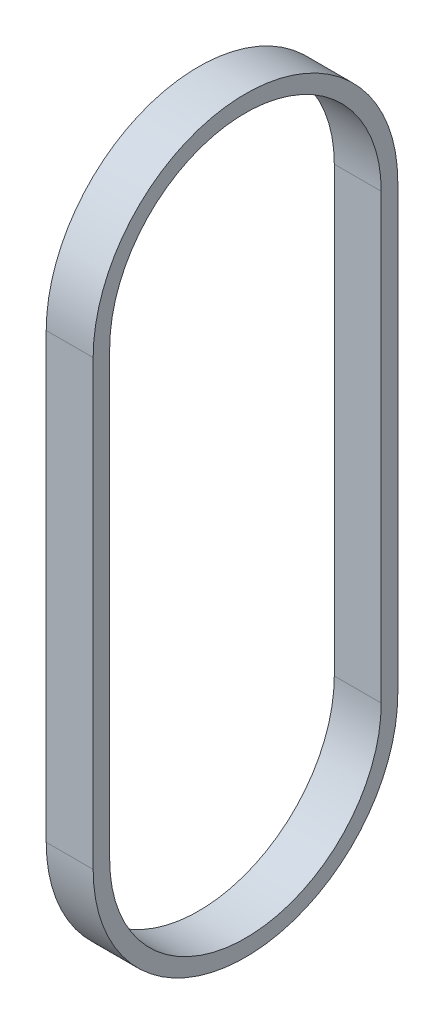
ISO-10303-21;
HEADER;
FILE_DESCRIPTION(('STEP AP214'),'2;1');
FILE_NAME('part.step','',(''),(''),'','','');
FILE_SCHEMA(('AUTOMOTIVE_DESIGN { 1 0 10303 214 1 1 1 1 }'));
ENDSEC;
DATA;
#1=APPLICATION_CONTEXT('core data for automotive mechanical design processes');
#2=APPLICATION_PROTOCOL_DEFINITION('international standard','automotive_design',2000,#1);
#3=PRODUCT_CONTEXT('',#1,'mechanical');
#4=PRODUCT('Part','Part','',(#3));
#5=PRODUCT_RELATED_PRODUCT_CATEGORY('part','',(#4));
#6=PRODUCT_DEFINITION_FORMATION('','',#4);
#7=PRODUCT_DEFINITION_CONTEXT('part definition',#1,'design');
#8=PRODUCT_DEFINITION('design','',#6,#7);
#9=PRODUCT_DEFINITION_SHAPE('','',#8);
#10=(LENGTH_UNIT() NAMED_UNIT(*) SI_UNIT(.MILLI.,.METRE.));
#11=(NAMED_UNIT(*) PLANE_ANGLE_UNIT() SI_UNIT($,.RADIAN.));
#12=(NAMED_UNIT(*) SI_UNIT($,.STERADIAN.) SOLID_ANGLE_UNIT());
#13=UNCERTAINTY_MEASURE_WITH_UNIT(LENGTH_MEASURE(1.E-05),#10,'distance_accuracy_value','');
#14=(GEOMETRIC_REPRESENTATION_CONTEXT(3) GLOBAL_UNCERTAINTY_ASSIGNED_CONTEXT((#13)) GLOBAL_UNIT_ASSIGNED_CONTEXT((#10,
#11,#12)) REPRESENTATION_CONTEXT('',''));
#15=CARTESIAN_POINT('',(0.,0.,0.));
#16=DIRECTION('',(0.,0.,1.));
#17=DIRECTION('',(1.,0.,0.));
#18=AXIS2_PLACEMENT_3D('',#15,#16,#17);
#19=CARTESIAN_POINT('',(9.,0.,0.));
#20=DIRECTION('',(1.,0.,0.));
#21=DIRECTION('',(0.,0.,-1.));
#22=AXIS2_PLACEMENT_3D('',#19,#20,#21);
#23=PLANE('',#22);
#24=CARTESIAN_POINT('',(9.,0.,0.));
#25=DIRECTION('',(1.,0.,0.));
#26=DIRECTION('',(0.,0.,-1.));
#27=AXIS2_PLACEMENT_3D('',#24,#25,#26);
#28=CIRCLE('',#27,29.21);
#29=CARTESIAN_POINT('',(9.,0.,29.21));
#30=VERTEX_POINT('',#29);
#31=CARTESIAN_POINT('',(9.,0.,-29.21));
#32=VERTEX_POINT('',#31);
#33=EDGE_CURVE('E136',#30,#32,#28,.T.);
#34=ORIENTED_EDGE('',*,*,#33,.T.);
#35=DIRECTION('',(0.,1.,0.));
#36=VECTOR('',#35,1.);
#37=CARTESIAN_POINT('',(9.,85.0011,-29.21));
#38=LINE('',#37,#36);
#39=CARTESIAN_POINT('',(9.,85.0011,-29.21));
#40=VERTEX_POINT('',#39);
#41=EDGE_CURVE('E139',#32,#40,#38,.T.);
#42=ORIENTED_EDGE('',*,*,#41,.T.);
#43=CARTESIAN_POINT('',(9.,85.0011,0.));
#44=DIRECTION('',(1.,0.,0.));
#45=DIRECTION('',(0.,0.,1.));
#46=AXIS2_PLACEMENT_3D('',#43,#44,#45);
#47=CIRCLE('',#46,29.21);
#48=CARTESIAN_POINT('',(9.,85.0011,29.21));
#49=VERTEX_POINT('',#48);
#50=EDGE_CURVE('E142',#40,#49,#47,.T.);
#51=ORIENTED_EDGE('',*,*,#50,.T.);
#52=DIRECTION('',(0.,-1.,0.));
#53=VECTOR('',#52,1.);
#54=CARTESIAN_POINT('',(9.,85.0011,29.21));
#55=LINE('',#54,#53);
#56=EDGE_CURVE('E144',#49,#30,#55,.T.);
#57=ORIENTED_EDGE('',*,*,#56,.T.);
#58=EDGE_LOOP('',(#34,#42,#51,#57));
#59=FACE_BOUND('',#58,.T.);
#60=DIRECTION('',(0.,-1.,0.));
#61=VECTOR('',#60,1.);
#62=CARTESIAN_POINT('',(9.,85.0011,26.035));
#63=LINE('',#62,#61);
#64=CARTESIAN_POINT('',(9.,85.0011,26.035));
#65=VERTEX_POINT('',#64);
#66=CARTESIAN_POINT('',(9.,0.,26.035));
#67=VERTEX_POINT('',#66);
#68=EDGE_CURVE('E108',#65,#67,#63,.T.);
#69=ORIENTED_EDGE('',*,*,#68,.F.);
#70=CARTESIAN_POINT('',(9.,85.0011,0.));
#71=DIRECTION('',(1.,0.,0.));
#72=DIRECTION('',(0.,0.,1.));
#73=AXIS2_PLACEMENT_3D('',#70,#71,#72);
#74=CIRCLE('',#73,26.035);
#75=CARTESIAN_POINT('',(9.,85.0011,-26.035));
#76=VERTEX_POINT('',#75);
#77=EDGE_CURVE('E100',#76,#65,#74,.T.);
#78=ORIENTED_EDGE('',*,*,#77,.F.);
#79=DIRECTION('',(0.,1.,0.));
#80=VECTOR('',#79,1.);
#81=CARTESIAN_POINT('',(9.,85.0011,-26.035));
#82=LINE('',#81,#80);
#83=CARTESIAN_POINT('',(9.,0.,-26.035));
#84=VERTEX_POINT('',#83);
#85=EDGE_CURVE('E122',#84,#76,#82,.T.);
#86=ORIENTED_EDGE('',*,*,#85,.F.);
#87=CARTESIAN_POINT('',(9.,0.,0.));
#88=DIRECTION('',(1.,0.,0.));
#89=DIRECTION('',(0.,0.,-1.));
#90=AXIS2_PLACEMENT_3D('',#87,#88,#89);
#91=CIRCLE('',#90,26.035);
#92=EDGE_CURVE('E120',#67,#84,#91,.T.);
#93=ORIENTED_EDGE('',*,*,#92,.F.);
#94=EDGE_LOOP('',(#69,#78,#86,#93));
#95=FACE_BOUND('',#94,.T.);
#96=ADVANCED_FACE('F35',(#59,#95),#23,.T.);
#97=CARTESIAN_POINT('',(0.,0.,0.));
#98=DIRECTION('',(1.,0.,0.));
#99=DIRECTION('',(0.,0.,-1.));
#100=AXIS2_PLACEMENT_3D('',#97,#98,#99);
#101=PLANE('',#100);
#102=CARTESIAN_POINT('',(0.,0.,0.));
#103=DIRECTION('',(1.,0.,0.));
#104=DIRECTION('',(0.,0.,-1.));
#105=AXIS2_PLACEMENT_3D('',#102,#103,#104);
#106=CIRCLE('',#105,29.21);
#107=CARTESIAN_POINT('',(0.,0.,29.21));
#108=VERTEX_POINT('',#107);
#109=CARTESIAN_POINT('',(0.,0.,-29.21));
#110=VERTEX_POINT('',#109);
#111=EDGE_CURVE('E116',#108,#110,#106,.T.);
#112=ORIENTED_EDGE('',*,*,#111,.F.);
#113=DIRECTION('',(0.,-1.,0.));
#114=VECTOR('',#113,1.);
#115=CARTESIAN_POINT('',(0.,85.0011,29.21));
#116=LINE('',#115,#114);
#117=CARTESIAN_POINT('',(0.,85.0011,29.21));
#118=VERTEX_POINT('',#117);
#119=EDGE_CURVE('E140',#118,#108,#116,.T.);
#120=ORIENTED_EDGE('',*,*,#119,.F.);
#121=CARTESIAN_POINT('',(0.,85.0011,0.));
#122=DIRECTION('',(1.,0.,0.));
#123=DIRECTION('',(0.,0.,1.));
#124=AXIS2_PLACEMENT_3D('',#121,#122,#123);
#125=CIRCLE('',#124,29.21);
#126=CARTESIAN_POINT('',(0.,85.0011,-29.21));
#127=VERTEX_POINT('',#126);
#128=EDGE_CURVE('E151',#127,#118,#125,.T.);
#129=ORIENTED_EDGE('',*,*,#128,.F.);
#130=DIRECTION('',(0.,1.,0.));
#131=VECTOR('',#130,1.);
#132=CARTESIAN_POINT('',(0.,85.0011,-29.21));
#133=LINE('',#132,#131);
#134=EDGE_CURVE('E149',#110,#127,#133,.T.);
#135=ORIENTED_EDGE('',*,*,#134,.F.);
#136=EDGE_LOOP('',(#112,#120,#129,#135));
#137=FACE_BOUND('',#136,.T.);
#138=CARTESIAN_POINT('',(0.,85.0011,0.));
#139=DIRECTION('',(1.,0.,0.));
#140=DIRECTION('',(0.,0.,1.));
#141=AXIS2_PLACEMENT_3D('',#138,#139,#140);
#142=CIRCLE('',#141,26.035);
#143=CARTESIAN_POINT('',(0.,85.0011,-26.035));
#144=VERTEX_POINT('',#143);
#145=CARTESIAN_POINT('',(0.,85.0011,26.035));
#146=VERTEX_POINT('',#145);
#147=EDGE_CURVE('E58',#144,#146,#142,.T.);
#148=ORIENTED_EDGE('',*,*,#147,.T.);
#149=DIRECTION('',(0.,-1.,0.));
#150=VECTOR('',#149,1.);
#151=CARTESIAN_POINT('',(0.,85.0011,26.035));
#152=LINE('',#151,#150);
#153=CARTESIAN_POINT('',(0.,0.,26.035));
#154=VERTEX_POINT('',#153);
#155=EDGE_CURVE('E115',#146,#154,#152,.T.);
#156=ORIENTED_EDGE('',*,*,#155,.T.);
#157=CARTESIAN_POINT('',(0.,0.,0.));
#158=DIRECTION('',(1.,0.,0.));
#159=DIRECTION('',(0.,0.,-1.));
#160=AXIS2_PLACEMENT_3D('',#157,#158,#159);
#161=CIRCLE('',#160,26.035);
#162=CARTESIAN_POINT('',(0.,0.,-26.035));
#163=VERTEX_POINT('',#162);
#164=EDGE_CURVE('E128',#154,#163,#161,.T.);
#165=ORIENTED_EDGE('',*,*,#164,.T.);
#166=DIRECTION('',(0.,1.,0.));
#167=VECTOR('',#166,1.);
#168=CARTESIAN_POINT('',(0.,85.0011,-26.035));
#169=LINE('',#168,#167);
#170=EDGE_CURVE('E109',#163,#144,#169,.T.);
#171=ORIENTED_EDGE('',*,*,#170,.T.);
#172=EDGE_LOOP('',(#148,#156,#165,#171));
#173=FACE_BOUND('',#172,.T.);
#174=ADVANCED_FACE('F169',(#137,#173),#101,.F.);
#175=CARTESIAN_POINT('',(9.,0.,0.));
#176=DIRECTION('',(-1.,0.,0.));
#177=DIRECTION('',(0.,0.,1.));
#178=AXIS2_PLACEMENT_3D('',#175,#176,#177);
#179=CYLINDRICAL_SURFACE('',#178,29.21);
#180=ORIENTED_EDGE('',*,*,#111,.T.);
#181=DIRECTION('',(-1.,0.,0.));
#182=VECTOR('',#181,1.);
#183=CARTESIAN_POINT('',(9.,0.,-29.21));
#184=LINE('',#183,#182);
#185=EDGE_CURVE('E11',#32,#110,#184,.T.);
#186=ORIENTED_EDGE('',*,*,#185,.F.);
#187=ORIENTED_EDGE('',*,*,#33,.F.);
#188=DIRECTION('',(-1.,0.,0.));
#189=VECTOR('',#188,1.);
#190=CARTESIAN_POINT('',(9.,0.,29.21));
#191=LINE('',#190,#189);
#192=EDGE_CURVE('E146',#30,#108,#191,.T.);
#193=ORIENTED_EDGE('',*,*,#192,.T.);
#194=EDGE_LOOP('',(#180,#186,#187,#193));
#195=FACE_BOUND('',#194,.T.);
#196=ADVANCED_FACE('F37',(#195),#179,.T.);
#197=CARTESIAN_POINT('',(9.,85.0011,-29.21));
#198=DIRECTION('',(0.,0.,1.));
#199=DIRECTION('',(0.,-1.,0.));
#200=AXIS2_PLACEMENT_3D('',#197,#198,#199);
#201=PLANE('',#200);
#202=ORIENTED_EDGE('',*,*,#134,.T.);
#203=DIRECTION('',(-1.,0.,0.));
#204=VECTOR('',#203,1.);
#205=CARTESIAN_POINT('',(9.,85.0011,-29.21));
#206=LINE('',#205,#204);
#207=EDGE_CURVE('E43',#40,#127,#206,.T.);
#208=ORIENTED_EDGE('',*,*,#207,.F.);
#209=ORIENTED_EDGE('',*,*,#41,.F.);
#210=ORIENTED_EDGE('',*,*,#185,.T.);
#211=EDGE_LOOP('',(#202,#208,#209,#210));
#212=FACE_BOUND('',#211,.T.);
#213=ADVANCED_FACE('F179',(#212),#201,.F.);
#214=CARTESIAN_POINT('',(9.,85.0011,0.));
#215=DIRECTION('',(-1.,0.,0.));
#216=DIRECTION('',(0.,0.,1.));
#217=AXIS2_PLACEMENT_3D('',#214,#215,#216);
#218=CYLINDRICAL_SURFACE('',#217,29.21);
#219=ORIENTED_EDGE('',*,*,#128,.T.);
#220=DIRECTION('',(-1.,0.,0.));
#221=VECTOR('',#220,1.);
#222=CARTESIAN_POINT('',(9.,85.0011,29.21));
#223=LINE('',#222,#221);
#224=EDGE_CURVE('E156',#49,#118,#223,.T.);
#225=ORIENTED_EDGE('',*,*,#224,.F.);
#226=ORIENTED_EDGE('',*,*,#50,.F.);
#227=ORIENTED_EDGE('',*,*,#207,.T.);
#228=EDGE_LOOP('',(#219,#225,#226,#227));
#229=FACE_BOUND('',#228,.T.);
#230=ADVANCED_FACE('F163',(#229),#218,.T.);
#231=CARTESIAN_POINT('',(9.,85.0011,29.21));
#232=DIRECTION('',(0.,0.,-1.));
#233=DIRECTION('',(0.,1.,0.));
#234=AXIS2_PLACEMENT_3D('',#231,#232,#233);
#235=PLANE('',#234);
#236=ORIENTED_EDGE('',*,*,#119,.T.);
#237=ORIENTED_EDGE('',*,*,#192,.F.);
#238=ORIENTED_EDGE('',*,*,#56,.F.);
#239=ORIENTED_EDGE('',*,*,#224,.T.);
#240=EDGE_LOOP('',(#236,#237,#238,#239));
#241=FACE_BOUND('',#240,.T.);
#242=ADVANCED_FACE('F173',(#241),#235,.F.);
#243=CARTESIAN_POINT('',(9.,85.0011,0.));
#244=DIRECTION('',(-1.,0.,0.));
#245=DIRECTION('',(0.,0.,1.));
#246=AXIS2_PLACEMENT_3D('',#243,#244,#245);
#247=CYLINDRICAL_SURFACE('',#246,26.035);
#248=ORIENTED_EDGE('',*,*,#147,.F.);
#249=DIRECTION('',(-1.,0.,0.));
#250=VECTOR('',#249,1.);
#251=CARTESIAN_POINT('',(9.,85.0011,-26.035));
#252=LINE('',#251,#250);
#253=EDGE_CURVE('E104',#76,#144,#252,.T.);
#254=ORIENTED_EDGE('',*,*,#253,.F.);
#255=ORIENTED_EDGE('',*,*,#77,.T.);
#256=DIRECTION('',(-1.,0.,0.));
#257=VECTOR('',#256,1.);
#258=CARTESIAN_POINT('',(9.,85.0011,26.035));
#259=LINE('',#258,#257);
#260=EDGE_CURVE('E103',#65,#146,#259,.T.);
#261=ORIENTED_EDGE('',*,*,#260,.T.);
#262=EDGE_LOOP('',(#248,#254,#255,#261));
#263=FACE_BOUND('',#262,.T.);
#264=ADVANCED_FACE('F102',(#263),#247,.F.);
#265=CARTESIAN_POINT('',(9.,85.0011,26.035));
#266=DIRECTION('',(0.,0.,-1.));
#267=DIRECTION('',(-1.,0.,0.));
#268=AXIS2_PLACEMENT_3D('',#265,#266,#267);
#269=PLANE('',#268);
#270=ORIENTED_EDGE('',*,*,#155,.F.);
#271=ORIENTED_EDGE('',*,*,#260,.F.);
#272=ORIENTED_EDGE('',*,*,#68,.T.);
#273=DIRECTION('',(-1.,0.,0.));
#274=VECTOR('',#273,1.);
#275=CARTESIAN_POINT('',(9.,0.,26.035));
#276=LINE('',#275,#274);
#277=EDGE_CURVE('E117',#67,#154,#276,.T.);
#278=ORIENTED_EDGE('',*,*,#277,.T.);
#279=EDGE_LOOP('',(#270,#271,#272,#278));
#280=FACE_BOUND('',#279,.T.);
#281=ADVANCED_FACE('F112',(#280),#269,.T.);
#282=CARTESIAN_POINT('',(9.,0.,0.));
#283=DIRECTION('',(-1.,0.,0.));
#284=DIRECTION('',(0.,0.,1.));
#285=AXIS2_PLACEMENT_3D('',#282,#283,#284);
#286=CYLINDRICAL_SURFACE('',#285,26.035);
#287=ORIENTED_EDGE('',*,*,#164,.F.);
#288=ORIENTED_EDGE('',*,*,#277,.F.);
#289=ORIENTED_EDGE('',*,*,#92,.T.);
#290=DIRECTION('',(-1.,0.,0.));
#291=VECTOR('',#290,1.);
#292=CARTESIAN_POINT('',(9.,0.,-26.035));
#293=LINE('',#292,#291);
#294=EDGE_CURVE('E50',#84,#163,#293,.T.);
#295=ORIENTED_EDGE('',*,*,#294,.T.);
#296=EDGE_LOOP('',(#287,#288,#289,#295));
#297=FACE_BOUND('',#296,.T.);
#298=ADVANCED_FACE('F202',(#297),#286,.F.);
#299=CARTESIAN_POINT('',(9.,85.0011,-26.035));
#300=DIRECTION('',(0.,0.,1.));
#301=DIRECTION('',(0.,-1.,0.));
#302=AXIS2_PLACEMENT_3D('',#299,#300,#301);
#303=PLANE('',#302);
#304=ORIENTED_EDGE('',*,*,#170,.F.);
#305=ORIENTED_EDGE('',*,*,#294,.F.);
#306=ORIENTED_EDGE('',*,*,#85,.T.);
#307=ORIENTED_EDGE('',*,*,#253,.T.);
#308=EDGE_LOOP('',(#304,#305,#306,#307));
#309=FACE_BOUND('',#308,.T.);
#310=ADVANCED_FACE('F206',(#309),#303,.T.);
#311=CLOSED_SHELL('',(#96,#174,#196,#213,#230,#242,#264,#281,#298,#310));
#312=MANIFOLD_SOLID_BREP('B2',#311);
#313=ADVANCED_BREP_SHAPE_REPRESENTATION('',(#18,#312),#14);
#314=SHAPE_DEFINITION_REPRESENTATION(#9,#313);
ENDSEC;
END-ISO-10303-21;
